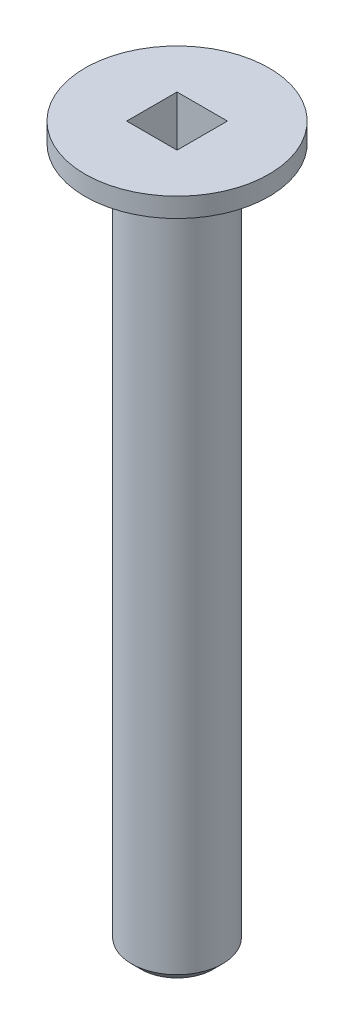
ISO-10303-21;
HEADER;
FILE_DESCRIPTION(('STEP AP214'),'2;1');
FILE_NAME('part.step','',(''),(''),'','','');
FILE_SCHEMA(('AUTOMOTIVE_DESIGN { 1 0 10303 214 1 1 1 1 }'));
ENDSEC;
DATA;
#1=APPLICATION_CONTEXT('core data for automotive mechanical design processes');
#2=APPLICATION_PROTOCOL_DEFINITION('international standard','automotive_design',2000,#1);
#3=PRODUCT_CONTEXT('',#1,'mechanical');
#4=PRODUCT('Part','Part','',(#3));
#5=PRODUCT_RELATED_PRODUCT_CATEGORY('part','',(#4));
#6=PRODUCT_DEFINITION_FORMATION('','',#4);
#7=PRODUCT_DEFINITION_CONTEXT('part definition',#1,'design');
#8=PRODUCT_DEFINITION('design','',#6,#7);
#9=PRODUCT_DEFINITION_SHAPE('','',#8);
#10=(LENGTH_UNIT() NAMED_UNIT(*) SI_UNIT(.MILLI.,.METRE.));
#11=(NAMED_UNIT(*) PLANE_ANGLE_UNIT() SI_UNIT($,.RADIAN.));
#12=(NAMED_UNIT(*) SI_UNIT($,.STERADIAN.) SOLID_ANGLE_UNIT());
#13=UNCERTAINTY_MEASURE_WITH_UNIT(LENGTH_MEASURE(1.E-05),#10,'distance_accuracy_value','');
#14=(GEOMETRIC_REPRESENTATION_CONTEXT(3) GLOBAL_UNCERTAINTY_ASSIGNED_CONTEXT((#13)) GLOBAL_UNIT_ASSIGNED_CONTEXT((#10,
#11,#12)) REPRESENTATION_CONTEXT('',''));
#15=CARTESIAN_POINT('',(0.,0.,0.));
#16=DIRECTION('',(0.,0.,1.));
#17=DIRECTION('',(1.,0.,0.));
#18=AXIS2_PLACEMENT_3D('',#15,#16,#17);
#19=CARTESIAN_POINT('',(0.,37.,0.));
#20=DIRECTION('',(0.,-1.,0.));
#21=DIRECTION('',(0.,0.,-1.));
#22=AXIS2_PLACEMENT_3D('',#19,#20,#21);
#23=CYLINDRICAL_SURFACE('',#22,2.35);
#24=CARTESIAN_POINT('',(0.,0.499999999999994,0.));
#25=DIRECTION('',(0.,1.,0.));
#26=DIRECTION('',(0.,0.,1.));
#27=AXIS2_PLACEMENT_3D('',#24,#25,#26);
#28=CIRCLE('',#27,2.35);
#29=CARTESIAN_POINT('',(0.,0.499999999999994,2.35));
#30=VERTEX_POINT('',#29);
#31=EDGE_CURVE('E51',#30,#30,#28,.T.);
#32=ORIENTED_EDGE('',*,*,#31,.T.);
#33=EDGE_LOOP('',(#32));
#34=FACE_BOUND('',#33,.T.);
#35=CARTESIAN_POINT('',(0.,34.4842105263158,0.));
#36=DIRECTION('',(0.,1.,0.));
#37=DIRECTION('',(0.,0.,1.));
#38=AXIS2_PLACEMENT_3D('',#35,#36,#37);
#39=CIRCLE('',#38,2.35);
#40=CARTESIAN_POINT('',(0.,34.4842105263158,2.35));
#41=VERTEX_POINT('',#40);
#42=EDGE_CURVE('E141',#41,#41,#39,.F.);
#43=ORIENTED_EDGE('',*,*,#42,.T.);
#44=EDGE_LOOP('',(#43));
#45=FACE_BOUND('',#44,.T.);
#46=ADVANCED_FACE('F41',(#34,#45),#23,.T.);
#47=CARTESIAN_POINT('',(0.,0.,0.));
#48=DIRECTION('',(0.,1.,0.));
#49=DIRECTION('',(0.,0.,1.));
#50=AXIS2_PLACEMENT_3D('',#47,#48,#49);
#51=PLANE('',#50);
#52=CARTESIAN_POINT('',(0.,0.,0.));
#53=DIRECTION('',(0.,1.,0.));
#54=DIRECTION('',(0.,0.,1.));
#55=AXIS2_PLACEMENT_3D('',#52,#53,#54);
#56=CIRCLE('',#55,1.85);
#57=CARTESIAN_POINT('',(0.,0.,1.85));
#58=VERTEX_POINT('',#57);
#59=EDGE_CURVE('E11',#58,#58,#56,.F.);
#60=ORIENTED_EDGE('',*,*,#59,.T.);
#61=EDGE_LOOP('',(#60));
#62=FACE_BOUND('',#61,.T.);
#63=ADVANCED_FACE('F165',(#62),#51,.F.);
#64=CARTESIAN_POINT('',(0.,36.,0.));
#65=DIRECTION('',(0.,1.,0.));
#66=DIRECTION('',(0.,0.,1.));
#67=AXIS2_PLACEMENT_3D('',#64,#65,#66);
#68=CONICAL_SURFACE('',#67,4.75,1.00748006530293);
#69=CARTESIAN_POINT('',(0.,36.,0.));
#70=DIRECTION('',(0.,1.,0.));
#71=DIRECTION('',(0.,0.,1.));
#72=AXIS2_PLACEMENT_3D('',#69,#70,#71);
#73=CIRCLE('',#72,4.75);
#74=CARTESIAN_POINT('',(0.,36.,4.75));
#75=VERTEX_POINT('',#74);
#76=EDGE_CURVE('E129',#75,#75,#73,.T.);
#77=ORIENTED_EDGE('',*,*,#76,.F.);
#78=EDGE_LOOP('',(#77));
#79=FACE_BOUND('',#78,.T.);
#80=ORIENTED_EDGE('',*,*,#42,.F.);
#81=EDGE_LOOP('',(#80));
#82=FACE_BOUND('',#81,.T.);
#83=ADVANCED_FACE('F169',(#79,#82),#68,.T.);
#84=CARTESIAN_POINT('',(0.,33.,0.));
#85=DIRECTION('',(0.,1.,0.));
#86=DIRECTION('',(0.,0.,1.));
#87=AXIS2_PLACEMENT_3D('',#84,#85,#86);
#88=CYLINDRICAL_SURFACE('',#87,4.75);
#89=ORIENTED_EDGE('',*,*,#76,.T.);
#90=EDGE_LOOP('',(#89));
#91=FACE_BOUND('',#90,.T.);
#92=CARTESIAN_POINT('',(0.,37.,0.));
#93=DIRECTION('',(0.,1.,0.));
#94=DIRECTION('',(0.,0.,1.));
#95=AXIS2_PLACEMENT_3D('',#92,#93,#94);
#96=CIRCLE('',#95,4.75);
#97=CARTESIAN_POINT('',(0.,37.,4.75));
#98=VERTEX_POINT('',#97);
#99=EDGE_CURVE('E137',#98,#98,#96,.T.);
#100=ORIENTED_EDGE('',*,*,#99,.F.);
#101=EDGE_LOOP('',(#100));
#102=FACE_BOUND('',#101,.T.);
#103=ADVANCED_FACE('F160',(#91,#102),#88,.T.);
#104=CARTESIAN_POINT('',(0.,37.,0.));
#105=DIRECTION('',(0.,1.,0.));
#106=DIRECTION('',(0.,0.,1.));
#107=AXIS2_PLACEMENT_3D('',#104,#105,#106);
#108=PLANE('',#107);
#109=DIRECTION('',(0.,0.,1.));
#110=VECTOR('',#109,1.);
#111=CARTESIAN_POINT('',(-1.3,37.,-1.3));
#112=LINE('',#111,#110);
#113=CARTESIAN_POINT('',(-1.3,37.,-1.3));
#114=VERTEX_POINT('',#113);
#115=CARTESIAN_POINT('',(-1.3,37.,1.3));
#116=VERTEX_POINT('',#115);
#117=EDGE_CURVE('E58',#114,#116,#112,.T.);
#118=ORIENTED_EDGE('',*,*,#117,.F.);
#119=DIRECTION('',(-1.,0.,0.));
#120=VECTOR('',#119,1.);
#121=CARTESIAN_POINT('',(1.3,37.,-1.3));
#122=LINE('',#121,#120);
#123=CARTESIAN_POINT('',(1.3,37.,-1.3));
#124=VERTEX_POINT('',#123);
#125=EDGE_CURVE('E113',#124,#114,#122,.T.);
#126=ORIENTED_EDGE('',*,*,#125,.F.);
#127=DIRECTION('',(0.,0.,-1.));
#128=VECTOR('',#127,1.);
#129=CARTESIAN_POINT('',(1.3,37.,-1.3));
#130=LINE('',#129,#128);
#131=CARTESIAN_POINT('',(1.3,37.,1.3));
#132=VERTEX_POINT('',#131);
#133=EDGE_CURVE('E122',#132,#124,#130,.T.);
#134=ORIENTED_EDGE('',*,*,#133,.F.);
#135=DIRECTION('',(1.,0.,0.));
#136=VECTOR('',#135,1.);
#137=CARTESIAN_POINT('',(1.3,37.,1.3));
#138=LINE('',#137,#136);
#139=EDGE_CURVE('E93',#116,#132,#138,.T.);
#140=ORIENTED_EDGE('',*,*,#139,.F.);
#141=EDGE_LOOP('',(#118,#126,#134,#140));
#142=FACE_BOUND('',#141,.T.);
#143=ORIENTED_EDGE('',*,*,#99,.T.);
#144=EDGE_LOOP('',(#143));
#145=FACE_BOUND('',#144,.T.);
#146=ADVANCED_FACE('F152',(#142,#145),#108,.T.);
#147=CARTESIAN_POINT('',(0.,0.499999999999994,0.));
#148=DIRECTION('',(0.,1.,0.));
#149=DIRECTION('',(0.,0.,1.));
#150=AXIS2_PLACEMENT_3D('',#147,#148,#149);
#151=CONICAL_SURFACE('',#150,2.35,0.78539816339745);
#152=ORIENTED_EDGE('',*,*,#59,.F.);
#153=EDGE_LOOP('',(#152));
#154=FACE_BOUND('',#153,.T.);
#155=ORIENTED_EDGE('',*,*,#31,.F.);
#156=EDGE_LOOP('',(#155));
#157=FACE_BOUND('',#156,.T.);
#158=ADVANCED_FACE('F44',(#154,#157),#151,.T.);
#159=CARTESIAN_POINT('',(-1.3,34.2,-1.3));
#160=DIRECTION('',(-1.,0.,0.));
#161=DIRECTION('',(0.,0.,1.));
#162=AXIS2_PLACEMENT_3D('',#159,#160,#161);
#163=PLANE('',#162);
#164=ORIENTED_EDGE('',*,*,#117,.T.);
#165=DIRECTION('',(0.,1.,0.));
#166=VECTOR('',#165,1.);
#167=CARTESIAN_POINT('',(-1.3,34.2,1.3));
#168=LINE('',#167,#166);
#169=CARTESIAN_POINT('',(-1.3,34.2,1.3));
#170=VERTEX_POINT('',#169);
#171=EDGE_CURVE('E81',#170,#116,#168,.T.);
#172=ORIENTED_EDGE('',*,*,#171,.F.);
#173=DIRECTION('',(0.,0.,1.));
#174=VECTOR('',#173,1.);
#175=CARTESIAN_POINT('',(-1.3,34.2,-1.3));
#176=LINE('',#175,#174);
#177=CARTESIAN_POINT('',(-1.3,34.2,-1.3));
#178=VERTEX_POINT('',#177);
#179=EDGE_CURVE('E109',#178,#170,#176,.T.);
#180=ORIENTED_EDGE('',*,*,#179,.F.);
#181=DIRECTION('',(0.,1.,0.));
#182=VECTOR('',#181,1.);
#183=CARTESIAN_POINT('',(-1.3,34.2,-1.3));
#184=LINE('',#183,#182);
#185=EDGE_CURVE('E66',#178,#114,#184,.T.);
#186=ORIENTED_EDGE('',*,*,#185,.T.);
#187=EDGE_LOOP('',(#164,#172,#180,#186));
#188=FACE_BOUND('',#187,.T.);
#189=ADVANCED_FACE('F151',(#188),#163,.F.);
#190=CARTESIAN_POINT('',(1.3,34.2,-1.3));
#191=DIRECTION('',(0.,0.,-1.));
#192=DIRECTION('',(-1.,0.,0.));
#193=AXIS2_PLACEMENT_3D('',#190,#191,#192);
#194=PLANE('',#193);
#195=ORIENTED_EDGE('',*,*,#125,.T.);
#196=ORIENTED_EDGE('',*,*,#185,.F.);
#197=DIRECTION('',(-1.,0.,0.));
#198=VECTOR('',#197,1.);
#199=CARTESIAN_POINT('',(1.3,34.2,-1.3));
#200=LINE('',#199,#198);
#201=CARTESIAN_POINT('',(1.3,34.2,-1.3));
#202=VERTEX_POINT('',#201);
#203=EDGE_CURVE('E106',#202,#178,#200,.T.);
#204=ORIENTED_EDGE('',*,*,#203,.F.);
#205=DIRECTION('',(0.,1.,0.));
#206=VECTOR('',#205,1.);
#207=CARTESIAN_POINT('',(1.3,34.2,-1.3));
#208=LINE('',#207,#206);
#209=EDGE_CURVE('E98',#202,#124,#208,.T.);
#210=ORIENTED_EDGE('',*,*,#209,.T.);
#211=EDGE_LOOP('',(#195,#196,#204,#210));
#212=FACE_BOUND('',#211,.T.);
#213=ADVANCED_FACE('F158',(#212),#194,.F.);
#214=CARTESIAN_POINT('',(1.3,34.2,-1.3));
#215=DIRECTION('',(1.,0.,0.));
#216=DIRECTION('',(0.,0.,-1.));
#217=AXIS2_PLACEMENT_3D('',#214,#215,#216);
#218=PLANE('',#217);
#219=ORIENTED_EDGE('',*,*,#133,.T.);
#220=ORIENTED_EDGE('',*,*,#209,.F.);
#221=DIRECTION('',(0.,0.,-1.));
#222=VECTOR('',#221,1.);
#223=CARTESIAN_POINT('',(1.3,34.2,-1.3));
#224=LINE('',#223,#222);
#225=CARTESIAN_POINT('',(1.3,34.2,1.3));
#226=VERTEX_POINT('',#225);
#227=EDGE_CURVE('E101',#226,#202,#224,.T.);
#228=ORIENTED_EDGE('',*,*,#227,.F.);
#229=DIRECTION('',(0.,1.,0.));
#230=VECTOR('',#229,1.);
#231=CARTESIAN_POINT('',(1.3,34.2,1.3));
#232=LINE('',#231,#230);
#233=EDGE_CURVE('E86',#226,#132,#232,.T.);
#234=ORIENTED_EDGE('',*,*,#233,.T.);
#235=EDGE_LOOP('',(#219,#220,#228,#234));
#236=FACE_BOUND('',#235,.T.);
#237=ADVANCED_FACE('F102',(#236),#218,.F.);
#238=CARTESIAN_POINT('',(1.3,34.2,1.3));
#239=DIRECTION('',(0.,0.,1.));
#240=DIRECTION('',(1.,0.,0.));
#241=AXIS2_PLACEMENT_3D('',#238,#239,#240);
#242=PLANE('',#241);
#243=ORIENTED_EDGE('',*,*,#139,.T.);
#244=ORIENTED_EDGE('',*,*,#233,.F.);
#245=DIRECTION('',(1.,0.,0.));
#246=VECTOR('',#245,1.);
#247=CARTESIAN_POINT('',(1.3,34.2,1.3));
#248=LINE('',#247,#246);
#249=EDGE_CURVE('E90',#170,#226,#248,.T.);
#250=ORIENTED_EDGE('',*,*,#249,.F.);
#251=ORIENTED_EDGE('',*,*,#171,.T.);
#252=EDGE_LOOP('',(#243,#244,#250,#251));
#253=FACE_BOUND('',#252,.T.);
#254=ADVANCED_FACE('F88',(#253),#242,.F.);
#255=CARTESIAN_POINT('',(0.,34.2,0.));
#256=DIRECTION('',(0.,-1.,0.));
#257=DIRECTION('',(0.,0.,-1.));
#258=AXIS2_PLACEMENT_3D('',#255,#256,#257);
#259=PLANE('',#258);
#260=ORIENTED_EDGE('',*,*,#179,.T.);
#261=ORIENTED_EDGE('',*,*,#249,.T.);
#262=ORIENTED_EDGE('',*,*,#227,.T.);
#263=ORIENTED_EDGE('',*,*,#203,.T.);
#264=EDGE_LOOP('',(#260,#261,#262,#263));
#265=FACE_BOUND('',#264,.T.);
#266=ADVANCED_FACE('F108',(#265),#259,.F.);
#267=CLOSED_SHELL('',(#46,#63,#83,#103,#146,#158,#189,#213,#237,#254,#266));
#268=MANIFOLD_SOLID_BREP('B2',#267);
#269=ADVANCED_BREP_SHAPE_REPRESENTATION('',(#18,#268),#14);
#270=SHAPE_DEFINITION_REPRESENTATION(#9,#269);
ENDSEC;
END-ISO-10303-21;
